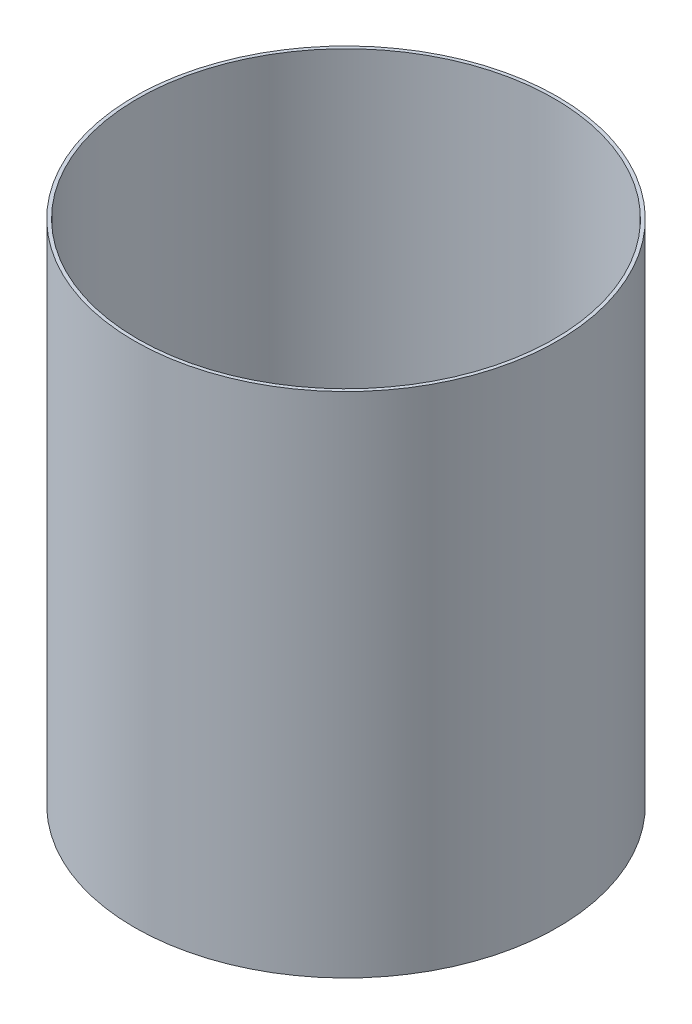
ISO-10303-21;
HEADER;
FILE_DESCRIPTION(('STEP AP214'),'2;1');
FILE_NAME('part.step','',(''),(''),'','','');
FILE_SCHEMA(('AUTOMOTIVE_DESIGN { 1 0 10303 214 1 1 1 1 }'));
ENDSEC;
DATA;
#1=APPLICATION_CONTEXT('core data for automotive mechanical design processes');
#2=APPLICATION_PROTOCOL_DEFINITION('international standard','automotive_design',2000,#1);
#3=PRODUCT_CONTEXT('',#1,'mechanical');
#4=PRODUCT('Part','Part','',(#3));
#5=PRODUCT_RELATED_PRODUCT_CATEGORY('part','',(#4));
#6=PRODUCT_DEFINITION_FORMATION('','',#4);
#7=PRODUCT_DEFINITION_CONTEXT('part definition',#1,'design');
#8=PRODUCT_DEFINITION('design','',#6,#7);
#9=PRODUCT_DEFINITION_SHAPE('','',#8);
#10=(LENGTH_UNIT() NAMED_UNIT(*) SI_UNIT(.MILLI.,.METRE.));
#11=(NAMED_UNIT(*) PLANE_ANGLE_UNIT() SI_UNIT($,.RADIAN.));
#12=(NAMED_UNIT(*) SI_UNIT($,.STERADIAN.) SOLID_ANGLE_UNIT());
#13=UNCERTAINTY_MEASURE_WITH_UNIT(LENGTH_MEASURE(1.E-05),#10,'distance_accuracy_value','');
#14=(GEOMETRIC_REPRESENTATION_CONTEXT(3) GLOBAL_UNCERTAINTY_ASSIGNED_CONTEXT((#13)) GLOBAL_UNIT_ASSIGNED_CONTEXT((#10,
#11,#12)) REPRESENTATION_CONTEXT('',''));
#15=CARTESIAN_POINT('',(0.,0.,0.));
#16=DIRECTION('',(0.,0.,1.));
#17=DIRECTION('',(1.,0.,0.));
#18=AXIS2_PLACEMENT_3D('',#15,#16,#17);
#19=CARTESIAN_POINT('',(0.,300.,0.));
#20=DIRECTION('',(0.,1.,0.));
#21=DIRECTION('',(0.,0.,1.));
#22=AXIS2_PLACEMENT_3D('',#19,#20,#21);
#23=PLANE('',#22);
#24=CARTESIAN_POINT('',(0.,300.,0.));
#25=DIRECTION('',(0.,1.,0.));
#26=DIRECTION('',(0.,0.,1.));
#27=AXIS2_PLACEMENT_3D('',#24,#25,#26);
#28=CIRCLE('',#27,125.);
#29=CARTESIAN_POINT('',(0.,300.,125.));
#30=VERTEX_POINT('',#29);
#31=EDGE_CURVE('E10',#30,#30,#28,.T.);
#32=ORIENTED_EDGE('',*,*,#31,.T.);
#33=EDGE_LOOP('',(#32));
#34=FACE_BOUND('',#33,.T.);
#35=CARTESIAN_POINT('',(0.,300.,0.));
#36=DIRECTION('',(0.,1.,0.));
#37=DIRECTION('',(0.,0.,1.));
#38=AXIS2_PLACEMENT_3D('',#35,#36,#37);
#39=CIRCLE('',#38,123.);
#40=CARTESIAN_POINT('',(0.,300.,123.));
#41=VERTEX_POINT('',#40);
#42=EDGE_CURVE('E49',#41,#41,#39,.T.);
#43=ORIENTED_EDGE('',*,*,#42,.F.);
#44=EDGE_LOOP('',(#43));
#45=FACE_BOUND('',#44,.T.);
#46=ADVANCED_FACE('F38',(#34,#45),#23,.T.);
#47=CARTESIAN_POINT('',(0.,0.,0.));
#48=DIRECTION('',(0.,1.,0.));
#49=DIRECTION('',(0.,0.,1.));
#50=AXIS2_PLACEMENT_3D('',#47,#48,#49);
#51=PLANE('',#50);
#52=CARTESIAN_POINT('',(0.,0.,0.));
#53=DIRECTION('',(0.,1.,0.));
#54=DIRECTION('',(0.,0.,1.));
#55=AXIS2_PLACEMENT_3D('',#52,#53,#54);
#56=CIRCLE('',#55,125.);
#57=CARTESIAN_POINT('',(0.,0.,125.));
#58=VERTEX_POINT('',#57);
#59=EDGE_CURVE('E42',#58,#58,#56,.T.);
#60=ORIENTED_EDGE('',*,*,#59,.F.);
#61=EDGE_LOOP('',(#60));
#62=FACE_BOUND('',#61,.T.);
#63=CARTESIAN_POINT('',(0.,0.,0.));
#64=DIRECTION('',(0.,1.,0.));
#65=DIRECTION('',(0.,0.,1.));
#66=AXIS2_PLACEMENT_3D('',#63,#64,#65);
#67=CIRCLE('',#66,123.);
#68=CARTESIAN_POINT('',(0.,0.,123.));
#69=VERTEX_POINT('',#68);
#70=EDGE_CURVE('E51',#69,#69,#67,.T.);
#71=ORIENTED_EDGE('',*,*,#70,.T.);
#72=EDGE_LOOP('',(#71));
#73=FACE_BOUND('',#72,.T.);
#74=ADVANCED_FACE('F61',(#62,#73),#51,.F.);
#75=CARTESIAN_POINT('',(0.,300.,0.));
#76=DIRECTION('',(0.,-1.,0.));
#77=DIRECTION('',(0.,0.,-1.));
#78=AXIS2_PLACEMENT_3D('',#75,#76,#77);
#79=CYLINDRICAL_SURFACE('',#78,125.);
#80=ORIENTED_EDGE('',*,*,#31,.F.);
#81=EDGE_LOOP('',(#80));
#82=FACE_BOUND('',#81,.T.);
#83=ORIENTED_EDGE('',*,*,#59,.T.);
#84=EDGE_LOOP('',(#83));
#85=FACE_BOUND('',#84,.T.);
#86=ADVANCED_FACE('F40',(#82,#85),#79,.T.);
#87=CARTESIAN_POINT('',(0.,300.,0.));
#88=DIRECTION('',(0.,-1.,0.));
#89=DIRECTION('',(0.,0.,-1.));
#90=AXIS2_PLACEMENT_3D('',#87,#88,#89);
#91=CYLINDRICAL_SURFACE('',#90,123.);
#92=ORIENTED_EDGE('',*,*,#42,.T.);
#93=EDGE_LOOP('',(#92));
#94=FACE_BOUND('',#93,.T.);
#95=ORIENTED_EDGE('',*,*,#70,.F.);
#96=EDGE_LOOP('',(#95));
#97=FACE_BOUND('',#96,.T.);
#98=ADVANCED_FACE('F57',(#94,#97),#91,.F.);
#99=CLOSED_SHELL('',(#46,#74,#86,#98));
#100=MANIFOLD_SOLID_BREP('B2',#99);
#101=ADVANCED_BREP_SHAPE_REPRESENTATION('',(#18,#100),#14);
#102=SHAPE_DEFINITION_REPRESENTATION(#9,#101);
ENDSEC;
END-ISO-10303-21;
